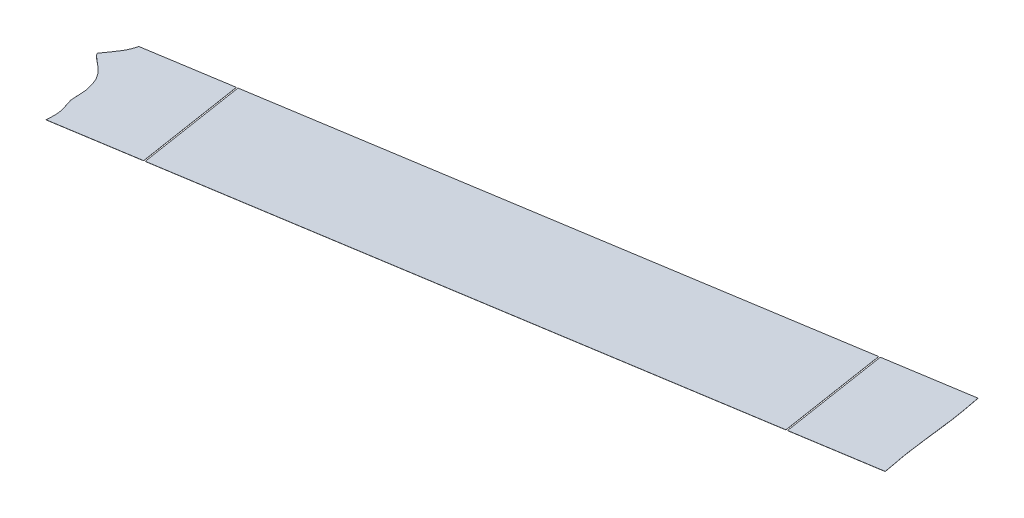
ISO-10303-21;
HEADER;
FILE_DESCRIPTION(('STEP AP214'),'2;1');
FILE_NAME('part.step','',(''),(''),'','','');
FILE_SCHEMA(('AUTOMOTIVE_DESIGN { 1 0 10303 214 1 1 1 1 }'));
ENDSEC;
DATA;
#1=APPLICATION_CONTEXT('core data for automotive mechanical design processes');
#2=APPLICATION_PROTOCOL_DEFINITION('international standard','automotive_design',2000,#1);
#3=PRODUCT_CONTEXT('',#1,'mechanical');
#4=PRODUCT('Part','Part','',(#3));
#5=PRODUCT_RELATED_PRODUCT_CATEGORY('part','',(#4));
#6=PRODUCT_DEFINITION_FORMATION('','',#4);
#7=PRODUCT_DEFINITION_CONTEXT('part definition',#1,'design');
#8=PRODUCT_DEFINITION('design','',#6,#7);
#9=PRODUCT_DEFINITION_SHAPE('','',#8);
#10=(LENGTH_UNIT() NAMED_UNIT(*) SI_UNIT(.MILLI.,.METRE.));
#11=(NAMED_UNIT(*) PLANE_ANGLE_UNIT() SI_UNIT($,.RADIAN.));
#12=(NAMED_UNIT(*) SI_UNIT($,.STERADIAN.) SOLID_ANGLE_UNIT());
#13=UNCERTAINTY_MEASURE_WITH_UNIT(LENGTH_MEASURE(1.E-05),#10,'distance_accuracy_value','');
#14=(GEOMETRIC_REPRESENTATION_CONTEXT(3) GLOBAL_UNCERTAINTY_ASSIGNED_CONTEXT((#13)) GLOBAL_UNIT_ASSIGNED_CONTEXT((#10,
#11,#12)) REPRESENTATION_CONTEXT('',''));
#15=CARTESIAN_POINT('',(0.,0.,0.));
#16=DIRECTION('',(0.,0.,1.));
#17=DIRECTION('',(1.,0.,0.));
#18=AXIS2_PLACEMENT_3D('',#15,#16,#17);
#19=CARTESIAN_POINT('',(2071.33887699728,381.384892477977,167.6098036128));
#20=DIRECTION('',(0.156902088768091,0.00396825396825129,0.987606190493282));
#21=DIRECTION('',(0.987613966521994,0.,-0.15690332415438));
#22=AXIS2_PLACEMENT_3D('',#19,#20,#21);
#23=PLANE('',#22);
#24=DIRECTION('',(-0.987613966521994,0.,0.15690332415438));
#25=VECTOR('',#24,1.);
#26=CARTESIAN_POINT('',(2071.33887699728,381.384892477977,167.6098036128));
#27=LINE('',#26,#25);
#28=CARTESIAN_POINT('',(2010.41756707299,381.384892477977,177.28843956063));
#29=VERTEX_POINT('',#28);
#30=CARTESIAN_POINT('',(1617.34720839724,381.384892477977,239.735962574076));
#31=VERTEX_POINT('',#30);
#32=EDGE_CURVE('E125',#29,#31,#27,.T.);
#33=ORIENTED_EDGE('',*,*,#32,.F.);
#34=DIRECTION('',(-0.00062263223863611,0.999992126449227,-0.00391910304130234));
#35=VECTOR('',#34,1.);
#36=CARTESIAN_POINT('',(2010.42379339538,371.384971213485,177.327630591043));
#37=LINE('',#36,#35);
#38=CARTESIAN_POINT('',(2010.41762933622,381.284893265332,177.288831470933));
#39=VERTEX_POINT('',#38);
#40=EDGE_CURVE('E66',#39,#29,#37,.T.);
#41=ORIENTED_EDGE('',*,*,#40,.F.);
#42=DIRECTION('',(-0.987613966521994,0.,0.15690332415438));
#43=VECTOR('',#42,1.);
#44=CARTESIAN_POINT('',(2071.33893926051,381.284893265333,167.610195523104));
#45=LINE('',#44,#43);
#46=CARTESIAN_POINT('',(1617.34727066046,381.284893265332,239.736354484378));
#47=VERTEX_POINT('',#46);
#48=EDGE_CURVE('E60',#39,#47,#45,.T.);
#49=ORIENTED_EDGE('',*,*,#48,.T.);
#50=DIRECTION('',(-0.00062263223863611,0.999992126449227,-0.00391910304130234));
#51=VECTOR('',#50,1.);
#52=CARTESIAN_POINT('',(1617.35343471963,371.384971213485,239.775153604489));
#53=LINE('',#52,#51);
#54=EDGE_CURVE('E108',#47,#31,#53,.T.);
#55=ORIENTED_EDGE('',*,*,#54,.T.);
#56=EDGE_LOOP('',(#33,#41,#49,#55));
#57=FACE_BOUND('',#56,.T.);
#58=ADVANCED_FACE('F57',(#57),#23,.F.);
#59=CARTESIAN_POINT('',(2083.79012268682,381.699900005905,246.008482464677));
#60=DIRECTION('',(0.156902088768096,0.00396825396825129,0.987606190493282));
#61=DIRECTION('',(0.987613966521993,0.,-0.156903324154385));
#62=AXIS2_PLACEMENT_3D('',#59,#60,#61);
#63=PLANE('',#62);
#64=DIRECTION('',(-0.00062263223863611,0.999992126449227,-0.00391910304130234));
#65=VECTOR('',#64,1.);
#66=CARTESIAN_POINT('',(2022.87897885242,371.699978741413,255.725683527698));
#67=LINE('',#66,#65);
#68=CARTESIAN_POINT('',(2022.87281479326,381.59990079326,255.686884407589));
#69=VERTEX_POINT('',#68);
#70=CARTESIAN_POINT('',(2022.87275253003,381.699900005905,255.686492497285));
#71=VERTEX_POINT('',#70);
#72=EDGE_CURVE('E115',#69,#71,#67,.T.);
#73=ORIENTED_EDGE('',*,*,#72,.T.);
#74=DIRECTION('',(-0.987613966521993,0.,0.156903324154385));
#75=VECTOR('',#74,1.);
#76=CARTESIAN_POINT('',(2083.79012268682,381.699900005905,246.008482464677));
#77=LINE('',#76,#75);
#78=CARTESIAN_POINT('',(1629.80239385428,381.699900005905,318.134015510731));
#79=VERTEX_POINT('',#78);
#80=EDGE_CURVE('E100',#71,#79,#77,.T.);
#81=ORIENTED_EDGE('',*,*,#80,.T.);
#82=DIRECTION('',(-0.00062263223863611,0.999992126449227,-0.00391910304130234));
#83=VECTOR('',#82,1.);
#84=CARTESIAN_POINT('',(1629.80862017666,371.699978741413,318.173206541144));
#85=LINE('',#84,#83);
#86=CARTESIAN_POINT('',(1629.8024561175,381.59990079326,318.134407421035));
#87=VERTEX_POINT('',#86);
#88=EDGE_CURVE('E118',#87,#79,#85,.T.);
#89=ORIENTED_EDGE('',*,*,#88,.F.);
#90=DIRECTION('',(-0.987613966521993,0.,0.156903324154385));
#91=VECTOR('',#90,1.);
#92=CARTESIAN_POINT('',(2083.79018495004,381.59990079326,246.008874374982));
#93=LINE('',#92,#91);
#94=EDGE_CURVE('E89',#69,#87,#93,.T.);
#95=ORIENTED_EDGE('',*,*,#94,.F.);
#96=EDGE_LOOP('',(#73,#81,#89,#95));
#97=FACE_BOUND('',#96,.T.);
#98=ADVANCED_FACE('F129',(#97),#63,.T.);
#99=CARTESIAN_POINT('',(-2946.66746904006,403.192390755681,6529.19275696574));
#100=DIRECTION('',(-0.00062263223863611,0.999992126449227,-0.00391910304130233));
#101=DIRECTION('',(0.,0.00391910380096367,0.99999232028321));
#102=AXIS2_PLACEMENT_3D('',#99,#100,#101);
#103=PLANE('',#102);
#104=DIRECTION('',(0.156902088768101,0.00396825396779671,0.987606190493283));
#105=VECTOR('',#104,1.);
#106=CARTESIAN_POINT('',(2022.87275253003,381.699900005905,255.686492497285));
#107=LINE('',#106,#105);
#108=EDGE_CURVE('E14',#29,#71,#107,.T.);
#109=ORIENTED_EDGE('',*,*,#108,.F.);
#110=ORIENTED_EDGE('',*,*,#32,.T.);
#111=DIRECTION('',(-0.156902088768099,-0.00396825396779671,-0.987606190493283));
#112=VECTOR('',#111,1.);
#113=CARTESIAN_POINT('',(1629.80239385428,381.699900005905,318.134015510731));
#114=LINE('',#113,#112);
#115=EDGE_CURVE('E114',#79,#31,#114,.T.);
#116=ORIENTED_EDGE('',*,*,#115,.F.);
#117=ORIENTED_EDGE('',*,*,#80,.F.);
#118=EDGE_LOOP('',(#109,#110,#116,#117));
#119=FACE_BOUND('',#118,.T.);
#120=ADVANCED_FACE('F130',(#119),#103,.T.);
#121=CARTESIAN_POINT('',(-2946.66740677683,403.092391543036,6529.19314887605));
#122=DIRECTION('',(-0.00062263223863611,0.999992126449227,-0.00391910304130233));
#123=DIRECTION('',(0.,0.00391910380096367,0.99999232028321));
#124=AXIS2_PLACEMENT_3D('',#121,#122,#123);
#125=PLANE('',#124);
#126=ORIENTED_EDGE('',*,*,#48,.F.);
#127=DIRECTION('',(0.156902088768102,0.0039682539677967,0.987606190493283));
#128=VECTOR('',#127,1.);
#129=CARTESIAN_POINT('',(2872.67142114136,403.092391543036,5604.66834725079));
#130=LINE('',#129,#128);
#131=EDGE_CURVE('E75',#39,#69,#130,.T.);
#132=ORIENTED_EDGE('',*,*,#131,.T.);
#133=ORIENTED_EDGE('',*,*,#94,.T.);
#134=DIRECTION('',(-0.156902088768099,-0.0039682539677967,-0.987606190493283));
#135=VECTOR('',#134,1.);
#136=CARTESIAN_POINT('',(2479.6010624656,403.092391543036,5667.11587026425));
#137=LINE('',#136,#135);
#138=EDGE_CURVE('E112',#87,#47,#137,.T.);
#139=ORIENTED_EDGE('',*,*,#138,.T.);
#140=EDGE_LOOP('',(#126,#132,#133,#139));
#141=FACE_BOUND('',#140,.T.);
#142=ADVANCED_FACE('F117',(#141),#125,.F.);
#143=CARTESIAN_POINT('',(1629.80862017666,371.699978741413,318.173206541144));
#144=DIRECTION('',(0.987613966521992,0.,-0.156903324154388));
#145=DIRECTION('',(-0.156903324154388,0.,-0.987613966521993));
#146=AXIS2_PLACEMENT_3D('',#143,#144,#145);
#147=PLANE('',#146);
#148=ORIENTED_EDGE('',*,*,#88,.T.);
#149=ORIENTED_EDGE('',*,*,#115,.T.);
#150=ORIENTED_EDGE('',*,*,#54,.F.);
#151=ORIENTED_EDGE('',*,*,#138,.F.);
#152=EDGE_LOOP('',(#148,#149,#150,#151));
#153=FACE_BOUND('',#152,.T.);
#154=ADVANCED_FACE('F111',(#153),#147,.F.);
#155=CARTESIAN_POINT('',(2022.87897885242,371.699978741413,255.725683527698));
#156=DIRECTION('',(-0.987613966521992,0.,0.156903324154391));
#157=DIRECTION('',(0.156903324154391,0.,0.987613966521992));
#158=AXIS2_PLACEMENT_3D('',#155,#156,#157);
#159=PLANE('',#158);
#160=ORIENTED_EDGE('',*,*,#40,.T.);
#161=ORIENTED_EDGE('',*,*,#108,.T.);
#162=ORIENTED_EDGE('',*,*,#72,.F.);
#163=ORIENTED_EDGE('',*,*,#131,.F.);
#164=EDGE_LOOP('',(#160,#161,#162,#163));
#165=FACE_BOUND('',#164,.T.);
#166=ADVANCED_FACE('F131',(#165),#159,.F.);
#167=CLOSED_SHELL('',(#58,#98,#120,#142,#154,#166));
#168=MANIFOLD_SOLID_BREP('B2',#167);
#169=CARTESIAN_POINT('',(2083.79012268682,381.699900005905,246.008482464679));
#170=CARTESIAN_POINT('',(2083.63100076041,381.696680753274,245.212342937488));
#171=CARTESIAN_POINT('',(2083.54692476346,381.694978013281,244.791231743634));
#172=CARTESIAN_POINT('',(2083.41236880606,381.692252933373,244.11728172317));
#173=CARTESIAN_POINT('',(2083.30421248932,381.690056020657,243.573903866964));
#174=CARTESIAN_POINT('',(2083.1752804441,381.687437103351,242.926148650787));
#175=CARTESIAN_POINT('',(2082.93644158216,381.682562055866,241.720183848063));
#176=CARTESIAN_POINT('',(2082.56804025949,381.674991496594,239.84702025756));
#177=CARTESIAN_POINT('',(2082.34729856242,381.670368050162,238.702378464453));
#178=CARTESIAN_POINT('',(2082.10300687589,381.665251347963,237.435619724111));
#179=CARTESIAN_POINT('',(2081.64810916562,381.655470930142,235.012333902094));
#180=CARTESIAN_POINT('',(2081.20708545204,381.645672781908,232.582319838726));
#181=CARTESIAN_POINT('',(2080.78243656861,381.635865883334,230.147471565162));
#182=CARTESIAN_POINT('',(2080.37579722953,381.626054804134,227.708695373436));
#183=CARTESIAN_POINT('',(2079.98801692212,381.616242486124,225.266606933729));
#184=CARTESIAN_POINT('',(2079.61918813814,381.606431457991,222.821836767649));
#185=CARTESIAN_POINT('',(2079.26868009701,381.596624685287,220.375241773165));
#186=CARTESIAN_POINT('',(2078.93520696045,381.586826780715,217.928203203138));
#187=CARTESIAN_POINT('',(2078.61697031648,381.577046878952,215.48333756265));
#188=CARTESIAN_POINT('',(2078.45668965038,381.571928197684,214.202726922303));
#189=CARTESIAN_POINT('',(2078.31201809104,381.567308004751,213.04682994006));
#190=CARTESIAN_POINT('',(2078.08181921326,381.559735983575,211.151336956759));
#191=CARTESIAN_POINT('',(2077.93523991659,381.554862210029,209.931039831124));
#192=CARTESIAN_POINT('',(2077.85700021854,381.552240227189,209.274448868812));
#193=CARTESIAN_POINT('',(2077.79167157867,381.550050922053,208.726208070414));
#194=CARTESIAN_POINT('',(2077.71051662001,381.547318234565,208.041833035924));
#195=CARTESIAN_POINT('',(2077.66178017357,381.545677158288,207.630841424769));
#196=CARTESIAN_POINT('',(2077.46722720374,381.539115585059,205.987509634997));
#197=CARTESIAN_POINT('',(2077.41848306409,381.537474249317,205.576453041544));
#198=CARTESIAN_POINT('',(2077.33733941831,381.53474194207,204.892173231685));
#199=CARTESIAN_POINT('',(2077.27199946555,381.532552256693,204.343837208654));
#200=CARTESIAN_POINT('',(2077.19377147413,381.529930664824,203.687344145871));
#201=CARTESIAN_POINT('',(2077.04719228637,381.525056891246,202.467046994773));
#202=CARTESIAN_POINT('',(2076.81699367081,381.517484871326,200.571554290554));
#203=CARTESIAN_POINT('',(2076.67231003371,381.512864286198,199.415559155166));
#204=CARTESIAN_POINT('',(2076.51204195025,381.507745999584,198.135047215058));
#205=CARTESIAN_POINT('',(2076.19380584808,381.497966097976,195.690181528328));
#206=CARTESIAN_POINT('',(2075.86033352064,381.488168198367,193.243144095872));
#207=CARTESIAN_POINT('',(2075.50982607054,381.478361422064,190.796548089197));
#208=CARTESIAN_POINT('',(2075.14099806021,381.468550394756,188.351778010634));
#209=CARTESIAN_POINT('',(2074.9451502618,381.463594689893,187.118402761275));
#210=CARTESIAN_POINT('',(2074.74943635516,381.458644834115,185.886498683729));
#211=CARTESIAN_POINT('',(2074.34314499168,381.448846119932,183.450822246676));
#212=CARTESIAN_POINT('',(2073.91889906168,381.439051592534,181.019066565374));
#213=CARTESIAN_POINT('',(2073.47833253701,381.429265810451,178.592135195488));
#214=CARTESIAN_POINT('',(2073.0239417836,381.419497743306,176.171920211721));
#215=CARTESIAN_POINT('',(2072.7799153439,381.414387032104,174.906647984319));
#216=CARTESIAN_POINT('',(2072.5594561504,381.409769896062,173.763571458903));
#217=CARTESIAN_POINT('',(2072.19150473933,381.40220887205,171.892769392025));
#218=CARTESIAN_POINT('',(2071.95296333888,381.397340001385,170.688333399093));
#219=CARTESIAN_POINT('',(2071.82417341825,381.394723996019,170.041298609471));
#220=CARTESIAN_POINT('',(2071.71617161742,381.392530242898,169.498702402193));
#221=CARTESIAN_POINT('',(2071.58176712438,381.389808236998,168.825512677576));
#222=CARTESIAN_POINT('',(2071.49780240828,381.388107754764,168.404959890719));
#223=CARTESIAN_POINT('',(2071.33887699728,381.384892477977,167.609803612801));
#224=B_SPLINE_CURVE_WITH_KNOTS('',2,(#169,#170,#171,#172,#173,#174,#175,#176,#177,#178,#179,
#180,#181,#182,#183,#184,#185,#186,#187,#188,#189,#190,#191,#192,#193,#194,#195,#196,#197,#198,
#199,#200,#201,#202,#203,#204,#205,#206,#207,#208,#209,#210,#211,#212,#213,#214,#215,#216,#217,
#218,#219,#220,#221,#222,#223),.UNSPECIFIED.,.F.,.F.,(3,2,2,1,1,2,1,1,1,1,1,1,1,1,1,2,1,1,2,2,1,
2,2,1,1,2,1,1,1,1,1,1,1,1,1,1,2,1,1,2,2,3),(0.,0.015625,0.03125,0.046875,0.0625,0.09375,0.125,
0.15625,0.1875,0.21875,0.25,0.28125,0.3125,0.34375,0.375,0.40625,0.4375,0.453125,0.46875,
0.484375,0.5,0.515625,0.53125,0.546875,0.5625,0.59375,0.625,0.65625,0.6875,0.71875,0.75,
0.750316619873047,0.781527042388916,0.812737464904785,0.843947887420654,0.875158309936523,
0.906368732452393,0.937579154968262,0.953184366226196,0.968789577484131,0.984394788742065,1.),.UNSPECIFIED.);
#225=DIRECTION('',(0.000622632238707982,-0.999992126449225,0.00391910304175121));
#226=VECTOR('',#225,1.);
#227=SURFACE_OF_LINEAR_EXTRUSION('',#224,#226);
#228=CARTESIAN_POINT('',(2083.79018495004,381.59990079326,246.008874374983));
#229=CARTESIAN_POINT('',(2083.63106302364,381.596681540629,245.212734847793));
#230=CARTESIAN_POINT('',(2083.54698702669,381.594978800636,244.791623653938));
#231=CARTESIAN_POINT('',(2083.41243106928,381.592253720728,244.117673633474));
#232=CARTESIAN_POINT('',(2083.30427475254,381.590056808012,243.574295777268));
#233=CARTESIAN_POINT('',(2083.17534270732,381.587437890706,242.926540561091));
#234=CARTESIAN_POINT('',(2082.93650384539,381.582562843221,241.720575758368));
#235=CARTESIAN_POINT('',(2082.56810252271,381.574992283949,239.847412167864));
#236=CARTESIAN_POINT('',(2082.34736082565,381.570368837517,238.702770374757));
#237=CARTESIAN_POINT('',(2082.10306913912,381.565252135318,237.436011634415));
#238=CARTESIAN_POINT('',(2081.64817142884,381.555471717497,235.012725812398));
#239=CARTESIAN_POINT('',(2081.20714771527,381.545673569263,232.58271174903));
#240=CARTESIAN_POINT('',(2080.78249883183,381.535866670689,230.147863475466));
#241=CARTESIAN_POINT('',(2080.37585949275,381.526055591489,227.70908728374));
#242=CARTESIAN_POINT('',(2079.98807918535,381.516243273479,225.266998844033));
#243=CARTESIAN_POINT('',(2079.61925040136,381.506432245346,222.822228677953));
#244=CARTESIAN_POINT('',(2079.26874236023,381.496625472642,220.37563368347));
#245=CARTESIAN_POINT('',(2078.93526922368,381.486827568071,217.928595113443));
#246=CARTESIAN_POINT('',(2078.61703257971,381.477047666307,215.483729472954));
#247=CARTESIAN_POINT('',(2078.45675191361,381.471928985039,214.203118832607));
#248=CARTESIAN_POINT('',(2078.31208035426,381.467308792107,213.047221850364));
#249=CARTESIAN_POINT('',(2078.08188147649,381.45973677093,211.151728867063));
#250=CARTESIAN_POINT('',(2077.93530217981,381.454862997384,209.931431741428));
#251=CARTESIAN_POINT('',(2077.85706248177,381.452241014544,209.274840779117));
#252=CARTESIAN_POINT('',(2077.79173384189,381.450051709409,208.726599980719));
#253=CARTESIAN_POINT('',(2077.71057888323,381.44731902192,208.042224946229));
#254=CARTESIAN_POINT('',(2077.66184243679,381.445677945643,207.631233335073));
#255=CARTESIAN_POINT('',(2077.46728946696,381.439116372414,205.987901545302));
#256=CARTESIAN_POINT('',(2077.41854532731,381.437475036672,205.576844951848));
#257=CARTESIAN_POINT('',(2077.33740168154,381.434742729425,204.89256514199));
#258=CARTESIAN_POINT('',(2077.27206172878,381.432553044048,204.344229118958));
#259=CARTESIAN_POINT('',(2077.19383373735,381.429931452179,203.687736056175));
#260=CARTESIAN_POINT('',(2077.04725454959,381.425057678601,202.467438905077));
#261=CARTESIAN_POINT('',(2076.81705593404,381.417485658681,200.571946200858));
#262=CARTESIAN_POINT('',(2076.67237229694,381.412865073553,199.415951065471));
#263=CARTESIAN_POINT('',(2076.51210421347,381.407746786939,198.135439125362));
#264=CARTESIAN_POINT('',(2076.19386811131,381.397966885332,195.690573438633));
#265=CARTESIAN_POINT('',(2075.86039578386,381.388168985722,193.243536006176));
#266=CARTESIAN_POINT('',(2075.50988833377,381.378362209419,190.796939999501));
#267=CARTESIAN_POINT('',(2075.14106032343,381.368551182111,188.352169920939));
#268=CARTESIAN_POINT('',(2074.94521252502,381.363595477248,187.11879467158));
#269=CARTESIAN_POINT('',(2074.74949861839,381.358645621471,185.886890594034));
#270=CARTESIAN_POINT('',(2074.3432072549,381.348846907287,183.45121415698));
#271=CARTESIAN_POINT('',(2073.9189613249,381.339052379889,181.019458475678));
#272=CARTESIAN_POINT('',(2073.47839480024,381.329266597806,178.592527105793));
#273=CARTESIAN_POINT('',(2073.02400404682,381.319498530661,176.172312122026));
#274=CARTESIAN_POINT('',(2072.77997760712,381.314387819459,174.907039894624));
#275=CARTESIAN_POINT('',(2072.55951841363,381.309770683417,173.763963369207));
#276=CARTESIAN_POINT('',(2072.19156700256,381.302209659405,171.893161302329));
#277=CARTESIAN_POINT('',(2071.95302560211,381.29734078874,170.688725309397));
#278=CARTESIAN_POINT('',(2071.82423568147,381.294724783375,170.041690519775));
#279=CARTESIAN_POINT('',(2071.71623388065,381.292531030253,169.499094312497));
#280=CARTESIAN_POINT('',(2071.58182938761,381.289809024353,168.82590458788));
#281=CARTESIAN_POINT('',(2071.4978646715,381.288108542119,168.405351801023));
#282=CARTESIAN_POINT('',(2071.33893926051,381.284893265332,167.610195523105));
#283=B_SPLINE_CURVE_WITH_KNOTS('',2,(#228,#229,#230,#231,#232,#233,#234,#235,#236,#237,#238,
#239,#240,#241,#242,#243,#244,#245,#246,#247,#248,#249,#250,#251,#252,#253,#254,#255,#256,#257,
#258,#259,#260,#261,#262,#263,#264,#265,#266,#267,#268,#269,#270,#271,#272,#273,#274,#275,#276,
#277,#278,#279,#280,#281,#282),.UNSPECIFIED.,.F.,.F.,(3,2,2,1,1,2,1,1,1,1,1,1,1,1,1,2,1,1,2,2,1,
2,2,1,1,2,1,1,1,1,1,1,1,1,1,1,2,1,1,2,2,3),(0.,0.015625,0.03125,0.046875,0.0625,0.09375,0.125,
0.15625,0.1875,0.21875,0.25,0.28125,0.3125,0.34375,0.375,0.40625,0.4375,0.453125,0.46875,
0.484375,0.5,0.515625,0.53125,0.546875,0.5625,0.59375,0.625,0.65625,0.6875,0.71875,0.75,
0.750316619873047,0.781527042388916,0.812737464904785,0.843947887420654,0.875158309936523,
0.906368732452393,0.937579154968262,0.953184366226196,0.968789577484131,0.984394788742065,1.),.UNSPECIFIED.);
#284=CARTESIAN_POINT('',(2083.79018495004,381.59990079326,246.008874374982));
#285=VERTEX_POINT('',#284);
#286=CARTESIAN_POINT('',(2071.33893926051,381.284893265332,167.610195523105));
#287=VERTEX_POINT('',#286);
#288=EDGE_CURVE('E260',#285,#287,#283,.T.);
#289=ORIENTED_EDGE('',*,*,#288,.T.);
#290=DIRECTION('',(0.000622632238707982,-0.999992126449225,0.00391910304175121));
#291=VECTOR('',#290,1.);
#292=CARTESIAN_POINT('',(2071.33887699728,381.384892477977,167.609803612801));
#293=LINE('',#292,#291);
#294=CARTESIAN_POINT('',(2071.33887699728,381.384892477977,167.609803612801));
#295=VERTEX_POINT('',#294);
#296=EDGE_CURVE('E248',#295,#287,#293,.T.);
#297=ORIENTED_EDGE('',*,*,#296,.F.);
#298=CARTESIAN_POINT('',(2083.79012268682,381.699900005905,246.008482464677));
#299=VERTEX_POINT('',#298);
#300=EDGE_CURVE('E247',#299,#295,#224,.T.);
#301=ORIENTED_EDGE('',*,*,#300,.F.);
#302=DIRECTION('',(0.000622632238707982,-0.999992126449225,0.00391910304175121));
#303=VECTOR('',#302,1.);
#304=CARTESIAN_POINT('',(2083.79012268682,381.699900005905,246.008482464677));
#305=LINE('',#304,#303);
#306=EDGE_CURVE('E197',#299,#285,#305,.T.);
#307=ORIENTED_EDGE('',*,*,#306,.T.);
#308=EDGE_LOOP('',(#289,#297,#301,#307));
#309=FACE_BOUND('',#308,.T.);
#310=ADVANCED_FACE('F189',(#309),#227,.F.);
#311=CARTESIAN_POINT('',(-2946.66746904006,403.192390755681,6529.19275696574));
#312=DIRECTION('',(-0.00062263223863611,0.999992126449227,-0.00391910304130233));
#313=DIRECTION('',(0.,0.00391910380096367,0.99999232028321));
#314=AXIS2_PLACEMENT_3D('',#311,#312,#313);
#315=PLANE('',#314);
#316=DIRECTION('',(-0.156902088768096,-0.00396825396779671,-0.987606190493283));
#317=VECTOR('',#316,1.);
#318=CARTESIAN_POINT('',(2011.40518103951,381.384892477977,177.131536236475));
#319=LINE('',#318,#317);
#320=CARTESIAN_POINT('',(2023.86036649655,381.699900005905,255.52958917313));
#321=VERTEX_POINT('',#320);
#322=CARTESIAN_POINT('',(2011.40518103951,381.384892477977,177.131536236475));
#323=VERTEX_POINT('',#322);
#324=EDGE_CURVE('E232',#321,#323,#319,.T.);
#325=ORIENTED_EDGE('',*,*,#324,.F.);
#326=DIRECTION('',(-0.987613966521993,0.,0.156903324154385));
#327=VECTOR('',#326,1.);
#328=CARTESIAN_POINT('',(2083.79012268682,381.699900005905,246.008482464677));
#329=LINE('',#328,#327);
#330=EDGE_CURVE('E244',#299,#321,#329,.T.);
#331=ORIENTED_EDGE('',*,*,#330,.F.);
#332=ORIENTED_EDGE('',*,*,#300,.T.);
#333=DIRECTION('',(-0.987613966521994,0.,0.15690332415438));
#334=VECTOR('',#333,1.);
#335=CARTESIAN_POINT('',(2071.33887699728,381.384892477977,167.6098036128));
#336=LINE('',#335,#334);
#337=EDGE_CURVE('E225',#295,#323,#336,.T.);
#338=ORIENTED_EDGE('',*,*,#337,.T.);
#339=EDGE_LOOP('',(#325,#331,#332,#338));
#340=FACE_BOUND('',#339,.T.);
#341=ADVANCED_FACE('F243',(#340),#315,.T.);
#342=CARTESIAN_POINT('',(-2946.66740677683,403.092391543036,6529.19314887605));
#343=DIRECTION('',(-0.00062263223863611,0.999992126449227,-0.00391910304130233));
#344=DIRECTION('',(0.,0.00391910380096367,0.99999232028321));
#345=AXIS2_PLACEMENT_3D('',#342,#343,#344);
#346=PLANE('',#345);
#347=DIRECTION('',(-0.987613966521993,0.,0.156903324154385));
#348=VECTOR('',#347,1.);
#349=CARTESIAN_POINT('',(2083.79018495004,381.59990079326,246.008874374982));
#350=LINE('',#349,#348);
#351=CARTESIAN_POINT('',(2023.86042875978,381.59990079326,255.529981083434));
#352=VERTEX_POINT('',#351);
#353=EDGE_CURVE('E259',#285,#352,#350,.T.);
#354=ORIENTED_EDGE('',*,*,#353,.T.);
#355=DIRECTION('',(-0.156902088768096,-0.0039682539677967,-0.987606190493283));
#356=VECTOR('',#355,1.);
#357=CARTESIAN_POINT('',(2873.65903510786,403.092391543036,5604.51144392667));
#358=LINE('',#357,#356);
#359=CARTESIAN_POINT('',(2011.40524330274,381.284893265332,177.131928146781));
#360=VERTEX_POINT('',#359);
#361=EDGE_CURVE('E55',#352,#360,#358,.T.);
#362=ORIENTED_EDGE('',*,*,#361,.T.);
#363=DIRECTION('',(-0.987613966521994,0.,0.15690332415438));
#364=VECTOR('',#363,1.);
#365=CARTESIAN_POINT('',(2071.33893926051,381.284893265333,167.610195523104));
#366=LINE('',#365,#364);
#367=EDGE_CURVE('E251',#287,#360,#366,.T.);
#368=ORIENTED_EDGE('',*,*,#367,.F.);
#369=ORIENTED_EDGE('',*,*,#288,.F.);
#370=EDGE_LOOP('',(#354,#362,#368,#369));
#371=FACE_BOUND('',#370,.T.);
#372=ADVANCED_FACE('F271',(#371),#346,.F.);
#373=CARTESIAN_POINT('',(2083.79012268682,381.699900005905,246.008482464677));
#374=DIRECTION('',(0.156902088768096,0.00396825396825129,0.987606190493282));
#375=DIRECTION('',(0.987613966521993,0.,-0.156903324154385));
#376=AXIS2_PLACEMENT_3D('',#373,#374,#375);
#377=PLANE('',#376);
#378=DIRECTION('',(-0.00062263223863611,0.999992126449227,-0.00391910304130234));
#379=VECTOR('',#378,1.);
#380=CARTESIAN_POINT('',(2023.86659281894,371.699978741413,255.568780203543));
#381=LINE('',#380,#379);
#382=EDGE_CURVE('E234',#352,#321,#381,.T.);
#383=ORIENTED_EDGE('',*,*,#382,.F.);
#384=ORIENTED_EDGE('',*,*,#353,.F.);
#385=ORIENTED_EDGE('',*,*,#306,.F.);
#386=ORIENTED_EDGE('',*,*,#330,.T.);
#387=EDGE_LOOP('',(#383,#384,#385,#386));
#388=FACE_BOUND('',#387,.T.);
#389=ADVANCED_FACE('F246',(#388),#377,.T.);
#390=CARTESIAN_POINT('',(2071.33887699728,381.384892477977,167.6098036128));
#391=DIRECTION('',(0.156902088768091,0.00396825396825129,0.987606190493282));
#392=DIRECTION('',(0.987613966521994,0.,-0.15690332415438));
#393=AXIS2_PLACEMENT_3D('',#390,#391,#392);
#394=PLANE('',#393);
#395=ORIENTED_EDGE('',*,*,#367,.T.);
#396=DIRECTION('',(-0.00062263223863611,0.999992126449227,-0.00391910304130234));
#397=VECTOR('',#396,1.);
#398=CARTESIAN_POINT('',(2011.4114073619,371.384971213485,177.170727266888));
#399=LINE('',#398,#397);
#400=EDGE_CURVE('E204',#360,#323,#399,.T.);
#401=ORIENTED_EDGE('',*,*,#400,.T.);
#402=ORIENTED_EDGE('',*,*,#337,.F.);
#403=ORIENTED_EDGE('',*,*,#296,.T.);
#404=EDGE_LOOP('',(#395,#401,#402,#403));
#405=FACE_BOUND('',#404,.T.);
#406=ADVANCED_FACE('F191',(#405),#394,.F.);
#407=CARTESIAN_POINT('',(2011.4114073619,371.384971213485,177.170727266888));
#408=DIRECTION('',(0.987613966521993,0.,-0.156903324154385));
#409=DIRECTION('',(-0.156903324154385,0.,-0.987613966521993));
#410=AXIS2_PLACEMENT_3D('',#407,#408,#409);
#411=PLANE('',#410);
#412=ORIENTED_EDGE('',*,*,#382,.T.);
#413=ORIENTED_EDGE('',*,*,#324,.T.);
#414=ORIENTED_EDGE('',*,*,#400,.F.);
#415=ORIENTED_EDGE('',*,*,#361,.F.);
#416=EDGE_LOOP('',(#412,#413,#414,#415));
#417=FACE_BOUND('',#416,.T.);
#418=ADVANCED_FACE('F235',(#417),#411,.F.);
#419=CLOSED_SHELL('',(#310,#341,#372,#389,#406,#418));
#420=MANIFOLD_SOLID_BREP('B8',#419);
#421=CARTESIAN_POINT('',(1556.42589847295,381.384892477977,249.414598521908));
#422=CARTESIAN_POINT('',(1556.19009339261,381.389920822655,250.735085602036));
#423=CARTESIAN_POINT('',(1555.37852415196,381.39935647511,253.271606645599));
#424=CARTESIAN_POINT('',(1554.80554035613,381.404110913768,254.575772255407));
#425=CARTESIAN_POINT('',(1554.75004560312,381.40456442998,254.700307246603));
#426=CARTESIAN_POINT('',(1554.23889534797,381.40868682257,255.83337741925));
#427=CARTESIAN_POINT('',(1553.59221942049,381.412929501415,257.018670755946));
#428=CARTESIAN_POINT('',(1553.52836703284,381.413344479694,257.134700256103));
#429=CARTESIAN_POINT('',(1552.92754953274,381.41721455027,258.217633877648));
#430=CARTESIAN_POINT('',(1552.19779519358,381.421298749177,259.375688483444));
#431=CARTESIAN_POINT('',(1552.12743284589,381.421689999827,259.486697923854));
#432=CARTESIAN_POINT('',(1551.48086588967,381.425264127463,260.501387480279));
#433=CARTESIAN_POINT('',(1550.69560963485,381.429229361001,261.637904721713));
#434=CARTESIAN_POINT('',(1550.29424427014,381.431247878078,262.216711702689));
#435=CARTESIAN_POINT('',(1549.87393051437,381.43329563274,262.805989251447));
#436=CARTESIAN_POINT('',(1549.53134325519,381.434964706491,263.286294684131));
#437=CARTESIAN_POINT('',(1549.07661173354,381.437140123997,263.913614470652));
#438=CARTESIAN_POINT('',(1548.92548724434,381.437863097541,264.12209657007));
#439=CARTESIAN_POINT('',(1548.37735779305,381.44047732689,264.876221124102));
#440=CARTESIAN_POINT('',(1548.27071025711,381.440986954572,265.023200128556));
#441=CARTESIAN_POINT('',(1547.78084917193,381.443327812868,265.698314597782));
#442=CARTESIAN_POINT('',(1547.47033067203,381.444847511786,266.13541098511));
#443=CARTESIAN_POINT('',(1547.01585748609,381.447071734848,266.775142877977));
#444=CARTESIAN_POINT('',(1546.68936085489,381.448780903208,267.263122451655));
#445=CARTESIAN_POINT('',(1546.25633282416,381.451047749902,267.910323107444));
#446=CARTESIAN_POINT('',(1545.96115399535,381.452862233206,268.420199181511));
#447=B_SPLINE_CURVE_WITH_KNOTS('',2,(#421,#422,#423,#424,#425,#426,#427,#428,#429,#430,#431,
#432,#433,#434,#435,#436,#437,#438,#439,#440,#441,#442,#443,#444,#445,#446),.UNSPECIFIED.,.F.,
.F.,(3,1,1,1,1,1,1,1,1,1,1,1,1,2,2,1,2,2,2,3),(0.,0.125,0.24375,0.25,0.25625,0.3690625,0.375,
0.38125,0.4940625,0.5,0.50625,0.6190625,0.625,0.6875,0.75,0.78125,0.8125,0.875,0.9375,1.),.UNSPECIFIED.);
#448=DIRECTION('',(0.000622632238707982,-0.999992126449225,0.00391910304175121));
#449=VECTOR('',#448,1.);
#450=SURFACE_OF_LINEAR_EXTRUSION('',#447,#449);
#451=CARTESIAN_POINT('',(1556.42596073617,381.284893265332,249.414990432213));
#452=CARTESIAN_POINT('',(1556.19015565583,381.28992161001,250.73547751234));
#453=CARTESIAN_POINT('',(1555.37858641519,381.299357262465,253.271998555903));
#454=CARTESIAN_POINT('',(1554.80560261935,381.304111701123,254.576164165712));
#455=CARTESIAN_POINT('',(1554.75010786635,381.304565217335,254.700699156907));
#456=CARTESIAN_POINT('',(1554.2389576112,381.308687609925,255.833769329554));
#457=CARTESIAN_POINT('',(1553.59228168371,381.31293028877,257.01906266625));
#458=CARTESIAN_POINT('',(1553.52842929606,381.313345267049,257.135092166407));
#459=CARTESIAN_POINT('',(1552.92761179596,381.317215337625,258.218025787952));
#460=CARTESIAN_POINT('',(1552.1978574568,381.321299536532,259.376080393748));
#461=CARTESIAN_POINT('',(1552.12749510912,381.321690787182,259.487089834158));
#462=CARTESIAN_POINT('',(1551.48092815289,381.325264914818,260.501779390583));
#463=CARTESIAN_POINT('',(1550.69567189807,381.329230148356,261.638296632017));
#464=CARTESIAN_POINT('',(1550.29430653336,381.331248665433,262.217103612993));
#465=CARTESIAN_POINT('',(1549.8739927776,381.333296420095,262.806381161751));
#466=CARTESIAN_POINT('',(1549.53140551842,381.334965493846,263.286686594435));
#467=CARTESIAN_POINT('',(1549.07667399677,381.337140911352,263.914006380956));
#468=CARTESIAN_POINT('',(1548.92554950756,381.337863884896,264.122488480374));
#469=CARTESIAN_POINT('',(1548.37742005628,381.340478114245,264.876613034406));
#470=CARTESIAN_POINT('',(1548.27077252033,381.340987741927,265.02359203886));
#471=CARTESIAN_POINT('',(1547.78091143515,381.343328600223,265.698706508086));
#472=CARTESIAN_POINT('',(1547.47039293525,381.344848299141,266.135802895414));
#473=CARTESIAN_POINT('',(1547.01591974931,381.347072522203,266.775534788281));
#474=CARTESIAN_POINT('',(1546.68942311811,381.348781690563,267.263514361959));
#475=CARTESIAN_POINT('',(1546.25639508739,381.351048537257,267.910715017748));
#476=CARTESIAN_POINT('',(1545.96121625858,381.352863020562,268.420591091815));
#477=B_SPLINE_CURVE_WITH_KNOTS('',2,(#451,#452,#453,#454,#455,#456,#457,#458,#459,#460,#461,
#462,#463,#464,#465,#466,#467,#468,#469,#470,#471,#472,#473,#474,#475,#476),.UNSPECIFIED.,.F.,
.F.,(3,1,1,1,1,1,1,1,1,1,1,1,1,2,2,1,2,2,2,3),(0.,0.125,0.24375,0.25,0.25625,0.3690625,0.375,
0.38125,0.4940625,0.5,0.50625,0.6190625,0.625,0.6875,0.75,0.78125,0.8125,0.875,0.9375,1.),.UNSPECIFIED.);
#478=CARTESIAN_POINT('',(1556.42596073617,381.284893265332,249.414990432213));
#479=VERTEX_POINT('',#478);
#480=CARTESIAN_POINT('',(1545.96121653857,381.35286301884,268.420590608169));
#481=VERTEX_POINT('',#480);
#482=EDGE_CURVE('E476',#479,#481,#477,.T.);
#483=ORIENTED_EDGE('',*,*,#482,.T.);
#484=DIRECTION('',(0.000622632238707982,-0.999992126449225,0.00391910304175121));
#485=VECTOR('',#484,1.);
#486=CARTESIAN_POINT('',(1545.96115427535,381.452862231485,268.420198697865));
#487=LINE('',#486,#485);
#488=CARTESIAN_POINT('',(1545.96115427535,381.452862231485,268.420198697865));
#489=VERTEX_POINT('',#488);
#490=EDGE_CURVE('E514',#489,#481,#487,.T.);
#491=ORIENTED_EDGE('',*,*,#490,.F.);
#492=CARTESIAN_POINT('',(1556.42589847295,381.384892477977,249.414598521908));
#493=VERTEX_POINT('',#492);
#494=EDGE_CURVE('E448',#493,#489,#447,.T.);
#495=ORIENTED_EDGE('',*,*,#494,.F.);
#496=DIRECTION('',(0.000622632238707982,-0.999992126449225,0.00391910304175121));
#497=VECTOR('',#496,1.);
#498=CARTESIAN_POINT('',(1556.42589847295,381.384892477977,249.414598521908));
#499=LINE('',#498,#497);
#500=EDGE_CURVE('E331',#493,#479,#499,.T.);
#501=ORIENTED_EDGE('',*,*,#500,.T.);
#502=EDGE_LOOP('',(#483,#491,#495,#501));
#503=FACE_BOUND('',#502,.T.);
#504=ADVANCED_FACE('F323',(#503),#450,.F.);
#505=CARTESIAN_POINT('',(1545.96115399535,381.452862233206,268.42019918151));
#506=CARTESIAN_POINT('',(1546.04638038849,381.45366577287,268.611689078258));
#507=CARTESIAN_POINT('',(1546.26437467638,381.455306391937,268.995673847799));
#508=CARTESIAN_POINT('',(1546.62160944332,381.457582775689,269.519758038584));
#509=CARTESIAN_POINT('',(1547.31402867999,381.461170908684,270.325294961605));
#510=CARTESIAN_POINT('',(1548.01126941156,381.464224915358,270.993779061815));
#511=CARTESIAN_POINT('',(1548.72507311415,381.467247691385,271.651663022194));
#512=CARTESIAN_POINT('',(1549.5063988996,381.470315564681,272.310326622242));
#513=CARTESIAN_POINT('',(1550.03092587712,381.472375118247,272.752506867371));
#514=CARTESIAN_POINT('',(1550.85605100636,381.4755392982,273.428785471314));
#515=CARTESIAN_POINT('',(1551.1956302187,381.476841512493,273.707107082796));
#516=CARTESIAN_POINT('',(1551.92166529732,381.479630482021,274.303390134918));
#517=CARTESIAN_POINT('',(1552.21370391327,381.480759756377,274.545137493376));
#518=CARTESIAN_POINT('',(1552.96806499142,381.48367677,275.169591890864));
#519=CARTESIAN_POINT('',(1553.56513622069,381.48605167486,275.680711487406));
#520=CARTESIAN_POINT('',(1554.26982638971,381.488854643795,276.283957695256));
#521=CARTESIAN_POINT('',(1555.5556926691,381.494205697651,277.445037125071));
#522=CARTESIAN_POINT('',(1556.22202242505,381.497153568991,278.091350762536));
#523=CARTESIAN_POINT('',(1557.49306246394,381.502820013238,279.335260166009));
#524=CARTESIAN_POINT('',(1558.51428449982,381.508160809455,280.535766596913));
#525=CARTESIAN_POINT('',(1558.62416075349,381.508741052334,280.666364289055));
#526=CARTESIAN_POINT('',(1559.79957002425,381.515021900746,282.082237052708));
#527=CARTESIAN_POINT('',(1561.12189138001,381.524140989836,284.198970727876));
#528=CARTESIAN_POINT('',(1561.92405752607,381.530746927301,285.757090247939));
#529=CARTESIAN_POINT('',(1562.59002802175,381.537532232282,287.382614452902));
#530=CARTESIAN_POINT('',(1563.11350308352,381.544437467589,289.061378297418));
#531=CARTESIAN_POINT('',(1563.31280980007,381.548000770552,289.938920960604));
#532=B_SPLINE_CURVE_WITH_KNOTS('',2,(#505,#506,#507,#508,#509,#510,#511,#512,#513,#514,#515,
#516,#517,#518,#519,#520,#521,#522,#523,#524,#525,#526,#527,#528,#529,#530,#531),.UNSPECIFIED.,
.F.,.F.,(3,1,1,1,1,1,2,2,1,2,2,1,1,1,1,1,1,1,1,1,1,3),(0.,0.015625,0.03125,0.0625,
0.109209060668945,0.125,0.1875,0.25,0.28125,0.3125,0.375,0.4375,0.5,0.50625,0.6190625,0.625,
0.63125,0.75,0.8125,0.875,0.9375,1.),.UNSPECIFIED.);
#533=DIRECTION('',(0.000622632238707982,-0.999992126449225,0.00391910304175121));
#534=VECTOR('',#533,1.);
#535=SURFACE_OF_LINEAR_EXTRUSION('',#532,#534);
#536=CARTESIAN_POINT('',(1545.96121625857,381.352863020562,268.420591091815));
#537=CARTESIAN_POINT('',(1546.04644265172,381.353666560225,268.612080988562));
#538=CARTESIAN_POINT('',(1546.26443693961,381.355307179292,268.996065758103));
#539=CARTESIAN_POINT('',(1546.62167170655,381.357583563044,269.520149948888));
#540=CARTESIAN_POINT('',(1547.31409094321,381.361171696039,270.325686871909));
#541=CARTESIAN_POINT('',(1548.01133167479,381.364225702713,270.994170972119));
#542=CARTESIAN_POINT('',(1548.72513537738,381.36724847874,271.652054932499));
#543=CARTESIAN_POINT('',(1549.50646116282,381.370316352036,272.310718532546));
#544=CARTESIAN_POINT('',(1550.03098814034,381.372375905602,272.752898777675));
#545=CARTESIAN_POINT('',(1550.85611326959,381.375540085555,273.429177381618));
#546=CARTESIAN_POINT('',(1551.19569248193,381.376842299848,273.7074989931));
#547=CARTESIAN_POINT('',(1551.92172756055,381.379631269376,274.303782045222));
#548=CARTESIAN_POINT('',(1552.2137661765,381.380760543732,274.54552940368));
#549=CARTESIAN_POINT('',(1552.96812725465,381.383677557355,275.169983801168));
#550=CARTESIAN_POINT('',(1553.56519848392,381.386052462215,275.68110339771));
#551=CARTESIAN_POINT('',(1554.26988865293,381.38885543115,276.28434960556));
#552=CARTESIAN_POINT('',(1555.55575493233,381.394206485006,277.445429035375));
#553=CARTESIAN_POINT('',(1556.22208468827,381.397154356346,278.09174267284));
#554=CARTESIAN_POINT('',(1557.49312472716,381.402820800593,279.335652076313));
#555=CARTESIAN_POINT('',(1558.51434676304,381.40816159681,280.536158507217));
#556=CARTESIAN_POINT('',(1558.62422301671,381.408741839689,280.666756199359));
#557=CARTESIAN_POINT('',(1559.79963228748,381.415022688101,282.082628963012));
#558=CARTESIAN_POINT('',(1561.12195364323,381.424141777191,284.19936263818));
#559=CARTESIAN_POINT('',(1561.9241197893,381.430747714656,285.757482158243));
#560=CARTESIAN_POINT('',(1562.59009028498,381.437533019637,287.383006363206));
#561=CARTESIAN_POINT('',(1563.11356534674,381.444438254944,289.061770207722));
#562=CARTESIAN_POINT('',(1563.31287206329,381.448001557907,289.939312870908));
#563=B_SPLINE_CURVE_WITH_KNOTS('',2,(#536,#537,#538,#539,#540,#541,#542,#543,#544,#545,#546,
#547,#548,#549,#550,#551,#552,#553,#554,#555,#556,#557,#558,#559,#560,#561,#562),.UNSPECIFIED.,
.F.,.F.,(3,1,1,1,1,1,2,2,1,2,2,1,1,1,1,1,1,1,1,1,1,3),(0.,0.015625,0.03125,0.0625,
0.109209060668945,0.125,0.1875,0.25,0.28125,0.3125,0.375,0.4375,0.5,0.50625,0.6190625,0.625,
0.63125,0.75,0.8125,0.875,0.9375,1.),.UNSPECIFIED.);
#564=CARTESIAN_POINT('',(1563.31287206329,381.448001557907,289.939312870908));
#565=VERTEX_POINT('',#564);
#566=EDGE_CURVE('E480',#481,#565,#563,.T.);
#567=ORIENTED_EDGE('',*,*,#566,.T.);
#568=DIRECTION('',(0.000622632238707982,-0.999992126449225,0.00391910304175121));
#569=VECTOR('',#568,1.);
#570=CARTESIAN_POINT('',(1563.31280980007,381.548000770552,289.938920960604));
#571=LINE('',#570,#569);
#572=CARTESIAN_POINT('',(1563.31280980007,381.548000770552,289.938920960604));
#573=VERTEX_POINT('',#572);
#574=EDGE_CURVE('E410',#573,#565,#571,.T.);
#575=ORIENTED_EDGE('',*,*,#574,.F.);
#576=EDGE_CURVE('E398',#489,#573,#532,.T.);
#577=ORIENTED_EDGE('',*,*,#576,.F.);
#578=ORIENTED_EDGE('',*,*,#490,.T.);
#579=EDGE_LOOP('',(#567,#575,#577,#578));
#580=FACE_BOUND('',#579,.T.);
#581=ADVANCED_FACE('F441',(#580),#535,.F.);
#582=CARTESIAN_POINT('',(1563.31280980007,381.548000770552,289.938920960604));
#583=CARTESIAN_POINT('',(1563.73755531948,381.552080835032,290.912503961988));
#584=CARTESIAN_POINT('',(1564.36421216638,381.560438211154,292.945401153229));
#585=CARTESIAN_POINT('',(1564.7688572318,381.568668152411,294.981053523422));
#586=CARTESIAN_POINT('',(1564.90186034782,381.573135002054,296.09967745332));
#587=CARTESIAN_POINT('',(1564.91391447179,381.573553343828,296.20450582571));
#588=CARTESIAN_POINT('',(1565.01860311579,381.577291037331,297.141577780848));
#589=CARTESIAN_POINT('',(1565.08715374611,381.581654553246,298.244074877984));
#590=CARTESIAN_POINT('',(1565.12016436964,381.583831870966,298.794391385553));
#591=CARTESIAN_POINT('',(1565.14550946373,381.586115204605,299.372976578387));
#592=CARTESIAN_POINT('',(1565.16572455907,381.587936377848,299.834452664825));
#593=CARTESIAN_POINT('',(1565.18746639053,381.590375218972,300.453289355398));
#594=CARTESIAN_POINT('',(1565.18753228761,381.590382610829,300.455164980852));
#595=CARTESIAN_POINT('',(1565.2238723636,381.594604003525,301.526515468699));
#596=CARTESIAN_POINT('',(1565.24555889421,381.597123188182,302.165861273895));
#597=CARTESIAN_POINT('',(1565.26267339861,381.598821028287,302.596360466465));
#598=CARTESIAN_POINT('',(1565.28581908976,381.601117190756,303.178568464601));
#599=CARTESIAN_POINT('',(1565.34105621273,381.605297712932,304.236488300718));
#600=CARTESIAN_POINT('',(1565.45637678329,381.611761517425,305.867461313547));
#601=CARTESIAN_POINT('',(1565.57872653425,381.615800845931,306.8786921387));
#602=B_SPLINE_CURVE_WITH_KNOTS('',2,(#582,#583,#584,#585,#586,#587,#588,#589,#590,#591,#592,
#593,#594,#595,#596,#597,#598,#599,#600,#601),.UNSPECIFIED.,.F.,.F.,(3,1,1,1,1,1,1,1,2,2,2,2,1,
1,3),(0.,0.125,0.25,0.36875,0.375,0.38125,0.4940625,0.5,0.5625,0.625,0.6875,0.75,0.8125,0.875,
1.),.UNSPECIFIED.);
#603=DIRECTION('',(0.000622632238707982,-0.999992126449225,0.00391910304175121));
#604=VECTOR('',#603,1.);
#605=SURFACE_OF_LINEAR_EXTRUSION('',#602,#604);
#606=CARTESIAN_POINT('',(1563.31287206329,381.448001557907,289.939312870908));
#607=CARTESIAN_POINT('',(1563.7376175827,381.452081622387,290.912895872293));
#608=CARTESIAN_POINT('',(1564.3642744296,381.460438998509,292.945793063533));
#609=CARTESIAN_POINT('',(1564.76891949502,381.468668939766,294.981445433726));
#610=CARTESIAN_POINT('',(1564.90192261105,381.47313578941,296.100069363624));
#611=CARTESIAN_POINT('',(1564.91397673501,381.473554131183,296.204897736015));
#612=CARTESIAN_POINT('',(1565.01866537902,381.477291824686,297.141969691152));
#613=CARTESIAN_POINT('',(1565.08721600933,381.481655340601,298.244466788289));
#614=CARTESIAN_POINT('',(1565.12022663286,381.483832658321,298.794783295858));
#615=CARTESIAN_POINT('',(1565.14557172695,381.48611599196,299.373368488691));
#616=CARTESIAN_POINT('',(1565.16578682229,381.487937165203,299.834844575129));
#617=CARTESIAN_POINT('',(1565.18752865375,381.490376006327,300.453681265702));
#618=CARTESIAN_POINT('',(1565.18759455083,381.490383398184,300.455556891156));
#619=CARTESIAN_POINT('',(1565.22393462682,381.49460479088,301.526907379003));
#620=CARTESIAN_POINT('',(1565.24562115743,381.497123975537,302.166253184199));
#621=CARTESIAN_POINT('',(1565.26273566184,381.498821815642,302.596752376769));
#622=CARTESIAN_POINT('',(1565.28588135298,381.501117978111,303.178960374905));
#623=CARTESIAN_POINT('',(1565.34111847596,381.505298500287,304.236880211022));
#624=CARTESIAN_POINT('',(1565.45643904651,381.51176230478,305.867853223852));
#625=CARTESIAN_POINT('',(1565.57878879748,381.515801633286,306.879084049005));
#626=B_SPLINE_CURVE_WITH_KNOTS('',2,(#606,#607,#608,#609,#610,#611,#612,#613,#614,#615,#616,
#617,#618,#619,#620,#621,#622,#623,#624,#625),.UNSPECIFIED.,.F.,.F.,(3,1,1,1,1,1,1,1,2,2,2,2,1,
1,3),(0.,0.125,0.25,0.36875,0.375,0.38125,0.4940625,0.5,0.5625,0.625,0.6875,0.75,0.8125,0.875,
1.),.UNSPECIFIED.);
#627=CARTESIAN_POINT('',(1565.57878847823,381.515801622746,306.879081410373));
#628=VERTEX_POINT('',#627);
#629=EDGE_CURVE('E407',#565,#628,#626,.T.);
#630=ORIENTED_EDGE('',*,*,#629,.T.);
#631=DIRECTION('',(0.000622632238707982,-0.999992126449225,0.00391910304175121));
#632=VECTOR('',#631,1.);
#633=CARTESIAN_POINT('',(1565.578726215,381.615800835391,306.878689500069));
#634=LINE('',#633,#632);
#635=CARTESIAN_POINT('',(1565.578726215,381.615800835391,306.878689500069));
#636=VERTEX_POINT('',#635);
#637=EDGE_CURVE('E404',#636,#628,#634,.T.);
#638=ORIENTED_EDGE('',*,*,#637,.F.);
#639=EDGE_CURVE('E391',#573,#636,#602,.T.);
#640=ORIENTED_EDGE('',*,*,#639,.F.);
#641=ORIENTED_EDGE('',*,*,#574,.T.);
#642=EDGE_LOOP('',(#630,#638,#640,#641));
#643=FACE_BOUND('',#642,.T.);
#644=ADVANCED_FACE('F405',(#643),#605,.F.);
#645=CARTESIAN_POINT('',(1565.57872653425,381.615800845931,306.8786921387));
#646=CARTESIAN_POINT('',(1565.82789389294,381.619508926587,307.785254633464));
#647=CARTESIAN_POINT('',(1566.28372693018,381.625398595964,309.215634646487));
#648=CARTESIAN_POINT('',(1566.60573149245,381.629414028813,310.189048913104));
#649=CARTESIAN_POINT('',(1566.96251461074,381.633739038536,311.235929016596));
#650=CARTESIAN_POINT('',(1567.31722619832,381.638052796185,312.280267165415));
#651=CARTESIAN_POINT('',(1567.46785595536,381.639923007163,312.733536520878));
#652=CARTESIAN_POINT('',(1567.80755732016,381.644158090754,313.760185012307));
#653=CARTESIAN_POINT('',(1568.04804713846,381.647474023372,314.568066244933));
#654=CARTESIAN_POINT('',(1568.0752755635,381.64785218162,314.660230694649));
#655=CARTESIAN_POINT('',(1568.36518933509,381.651916494723,315.651215468746));
#656=CARTESIAN_POINT('',(1568.57062804187,381.655489525314,316.530266021994));
#657=CARTESIAN_POINT('',(1568.59249207126,381.655875371915,316.625244467023));
#658=CARTESIAN_POINT('',(1568.82399256082,381.6600353445,317.649917745795));
#659=CARTESIAN_POINT('',(1569.09952739566,381.66780552858,319.588771087925));
#660=CARTESIAN_POINT('',(1569.17253893175,381.67573824545,321.601271140112));
#661=CARTESIAN_POINT('',(1569.09480057194,381.67962274071,322.604783179303));
#662=B_SPLINE_CURVE_WITH_KNOTS('',2,(#645,#646,#647,#648,#649,#650,#651,#652,#653,#654,#655,
#656,#657,#658,#659,#660,#661),.UNSPECIFIED.,.F.,.F.,(3,1,1,1,1,1,1,1,1,1,1,1,1,1,1,3),(0.,
0.125,0.178571428571429,0.25,0.3125,0.375,0.38125,0.4940625,0.5,0.50625,0.6190625,0.625,0.63125,
0.75,0.875,1.),.UNSPECIFIED.);
#663=DIRECTION('',(0.000622632238707982,-0.999992126449225,0.00391910304175121));
#664=VECTOR('',#663,1.);
#665=SURFACE_OF_LINEAR_EXTRUSION('',#662,#664);
#666=CARTESIAN_POINT('',(1565.57878879748,381.515801633286,306.879084049005));
#667=CARTESIAN_POINT('',(1565.82795615617,381.519509713942,307.785646543768));
#668=CARTESIAN_POINT('',(1566.28378919341,381.525399383319,309.216026556791));
#669=CARTESIAN_POINT('',(1566.60579375567,381.529414816169,310.189440823408));
#670=CARTESIAN_POINT('',(1566.96257687397,381.533739825891,311.2363209269));
#671=CARTESIAN_POINT('',(1567.31728846155,381.53805358354,312.280659075719));
#672=CARTESIAN_POINT('',(1567.46791821858,381.539923794518,312.733928431182));
#673=CARTESIAN_POINT('',(1567.80761958338,381.544158878109,313.760576922611));
#674=CARTESIAN_POINT('',(1568.04810940169,381.547474810727,314.568458155237));
#675=CARTESIAN_POINT('',(1568.07533782672,381.547852968975,314.660622604954));
#676=CARTESIAN_POINT('',(1568.36525159832,381.551917282078,315.65160737905));
#677=CARTESIAN_POINT('',(1568.5706903051,381.55549031267,316.530657932298));
#678=CARTESIAN_POINT('',(1568.59255433449,381.55587615927,316.625636377327));
#679=CARTESIAN_POINT('',(1568.82405482404,381.560036131855,317.650309656099));
#680=CARTESIAN_POINT('',(1569.09958965888,381.567806315935,319.589162998229));
#681=CARTESIAN_POINT('',(1569.17260119498,381.575739032805,321.601663050417));
#682=CARTESIAN_POINT('',(1569.09486283517,381.579623528065,322.605175089608));
#683=B_SPLINE_CURVE_WITH_KNOTS('',2,(#666,#667,#668,#669,#670,#671,#672,#673,#674,#675,#676,
#677,#678,#679,#680,#681,#682),.UNSPECIFIED.,.F.,.F.,(3,1,1,1,1,1,1,1,1,1,1,1,1,1,1,3),(0.,
0.125,0.178571428571429,0.25,0.3125,0.375,0.38125,0.4940625,0.5,0.50625,0.6190625,0.625,0.63125,
0.75,0.875,1.),.UNSPECIFIED.);
#684=CARTESIAN_POINT('',(1569.094863058,381.579623516931,322.605172213117));
#685=VERTEX_POINT('',#684);
#686=EDGE_CURVE('E493',#628,#685,#683,.T.);
#687=ORIENTED_EDGE('',*,*,#686,.T.);
#688=DIRECTION('',(0.000622632238707982,-0.999992126449225,0.00391910304175121));
#689=VECTOR('',#688,1.);
#690=CARTESIAN_POINT('',(1569.09480079477,381.679622729575,322.604780302813));
#691=LINE('',#690,#689);
#692=CARTESIAN_POINT('',(1569.09480079477,381.679622729575,322.604780302813));
#693=VERTEX_POINT('',#692);
#694=EDGE_CURVE('E411',#693,#685,#691,.T.);
#695=ORIENTED_EDGE('',*,*,#694,.F.);
#696=EDGE_CURVE('E395',#636,#693,#662,.T.);
#697=ORIENTED_EDGE('',*,*,#696,.F.);
#698=ORIENTED_EDGE('',*,*,#637,.T.);
#699=EDGE_LOOP('',(#687,#695,#697,#698));
#700=FACE_BOUND('',#699,.T.);
#701=ADVANCED_FACE('F413',(#700),#665,.F.);
#702=CARTESIAN_POINT('',(1569.09480057194,381.67962274071,322.604783179303));
#703=CARTESIAN_POINT('',(1569.22436207947,381.684928653165,323.9380478198));
#704=CARTESIAN_POINT('',(1569.13836217438,381.694981179703,326.516697474061));
#705=CARTESIAN_POINT('',(1568.91521480596,381.699900005905,327.807229048514));
#706=B_SPLINE_CURVE_WITH_KNOTS('',2,(#702,#703,#704,#705),.UNSPECIFIED.,.F.,.F.,(3,1,3),(0.,0.5,
1.),.UNSPECIFIED.);
#707=DIRECTION('',(0.000622632238707982,-0.999992126449225,0.00391910304175121));
#708=VECTOR('',#707,1.);
#709=SURFACE_OF_LINEAR_EXTRUSION('',#706,#708);
#710=CARTESIAN_POINT('',(1569.09486283517,381.579623528065,322.605175089608));
#711=CARTESIAN_POINT('',(1569.22442434269,381.58492944052,323.938439730104));
#712=CARTESIAN_POINT('',(1569.1384244376,381.594981967059,326.517089384365));
#713=CARTESIAN_POINT('',(1568.91527706919,381.59990079326,327.807620958818));
#714=B_SPLINE_CURVE_WITH_KNOTS('',2,(#710,#711,#712,#713),.UNSPECIFIED.,.F.,.F.,(3,1,3),(0.,0.5,
1.),.UNSPECIFIED.);
#715=CARTESIAN_POINT('',(1568.91527706919,381.59990079326,327.807620958818));
#716=VERTEX_POINT('',#715);
#717=EDGE_CURVE('E500',#685,#716,#714,.T.);
#718=ORIENTED_EDGE('',*,*,#717,.T.);
#719=DIRECTION('',(0.000622632238707982,-0.999992126449225,0.00391910304175121));
#720=VECTOR('',#719,1.);
#721=CARTESIAN_POINT('',(1568.91521480596,381.699900005905,327.807229048514));
#722=LINE('',#721,#720);
#723=CARTESIAN_POINT('',(1568.91521480596,381.699900005905,327.807229048514));
#724=VERTEX_POINT('',#723);
#725=EDGE_CURVE('E472',#724,#716,#722,.T.);
#726=ORIENTED_EDGE('',*,*,#725,.F.);
#727=EDGE_CURVE('E416',#693,#724,#706,.T.);
#728=ORIENTED_EDGE('',*,*,#727,.F.);
#729=ORIENTED_EDGE('',*,*,#694,.T.);
#730=EDGE_LOOP('',(#718,#726,#728,#729));
#731=FACE_BOUND('',#730,.T.);
#732=ADVANCED_FACE('F437',(#731),#709,.F.);
#733=CARTESIAN_POINT('',(-2946.66740677683,403.092391543036,6529.19314887605));
#734=DIRECTION('',(-0.00062263223863611,0.999992126449227,-0.00391910304130233));
#735=DIRECTION('',(0.,0.00391910380096367,0.99999232028321));
#736=AXIS2_PLACEMENT_3D('',#733,#734,#735);
#737=PLANE('',#736);
#738=DIRECTION('',(-0.987613966521994,0.,0.15690332415438));
#739=VECTOR('',#738,1.);
#740=CARTESIAN_POINT('',(2071.33893926051,381.284893265333,167.610195523104));
#741=LINE('',#740,#739);
#742=CARTESIAN_POINT('',(1616.35965669394,381.284893265332,239.893257808534));
#743=VERTEX_POINT('',#742);
#744=EDGE_CURVE('E465',#743,#479,#741,.T.);
#745=ORIENTED_EDGE('',*,*,#744,.F.);
#746=DIRECTION('',(0.156902088768099,0.0039682539677967,0.987606190493283));
#747=VECTOR('',#746,1.);
#748=CARTESIAN_POINT('',(2478.61344849907,403.092391543036,5667.27277358841));
#749=LINE('',#748,#747);
#750=CARTESIAN_POINT('',(1628.81484215098,381.59990079326,318.291310745187));
#751=VERTEX_POINT('',#750);
#752=EDGE_CURVE('E187',#743,#751,#749,.T.);
#753=ORIENTED_EDGE('',*,*,#752,.T.);
#754=DIRECTION('',(-0.987613966521993,0.,0.156903324154385));
#755=VECTOR('',#754,1.);
#756=CARTESIAN_POINT('',(2083.79018495004,381.59990079326,246.008874374982));
#757=LINE('',#756,#755);
#758=EDGE_CURVE('E373',#751,#716,#757,.T.);
#759=ORIENTED_EDGE('',*,*,#758,.T.);
#760=ORIENTED_EDGE('',*,*,#717,.F.);
#761=ORIENTED_EDGE('',*,*,#686,.F.);
#762=ORIENTED_EDGE('',*,*,#629,.F.);
#763=ORIENTED_EDGE('',*,*,#566,.F.);
#764=ORIENTED_EDGE('',*,*,#482,.F.);
#765=EDGE_LOOP('',(#745,#753,#759,#760,#761,#762,#763,#764));
#766=FACE_BOUND('',#765,.T.);
#767=ADVANCED_FACE('F524',(#766),#737,.F.);
#768=CARTESIAN_POINT('',(-2946.66746904006,403.192390755681,6529.19275696574));
#769=DIRECTION('',(-0.00062263223863611,0.999992126449227,-0.00391910304130233));
#770=DIRECTION('',(0.,0.00391910380096367,0.99999232028321));
#771=AXIS2_PLACEMENT_3D('',#768,#769,#770);
#772=PLANE('',#771);
#773=DIRECTION('',(0.156902088768099,0.00396825396779671,0.987606190493283));
#774=VECTOR('',#773,1.);
#775=CARTESIAN_POINT('',(1616.35959443072,381.384892477977,239.892865898231));
#776=LINE('',#775,#774);
#777=CARTESIAN_POINT('',(1616.35959443072,381.384892477977,239.892865898231));
#778=VERTEX_POINT('',#777);
#779=CARTESIAN_POINT('',(1628.81477988776,381.699900005905,318.290918834885));
#780=VERTEX_POINT('',#779);
#781=EDGE_CURVE('E463',#778,#780,#776,.T.);
#782=ORIENTED_EDGE('',*,*,#781,.F.);
#783=DIRECTION('',(-0.987613966521994,0.,0.15690332415438));
#784=VECTOR('',#783,1.);
#785=CARTESIAN_POINT('',(2071.33887699728,381.384892477977,167.6098036128));
#786=LINE('',#785,#784);
#787=EDGE_CURVE('E381',#778,#493,#786,.T.);
#788=ORIENTED_EDGE('',*,*,#787,.T.);
#789=ORIENTED_EDGE('',*,*,#494,.T.);
#790=ORIENTED_EDGE('',*,*,#576,.T.);
#791=ORIENTED_EDGE('',*,*,#639,.T.);
#792=ORIENTED_EDGE('',*,*,#696,.T.);
#793=ORIENTED_EDGE('',*,*,#727,.T.);
#794=DIRECTION('',(-0.987613966521993,0.,0.156903324154385));
#795=VECTOR('',#794,1.);
#796=CARTESIAN_POINT('',(2083.79012268682,381.699900005905,246.008482464677));
#797=LINE('',#796,#795);
#798=EDGE_CURVE('E345',#780,#724,#797,.T.);
#799=ORIENTED_EDGE('',*,*,#798,.F.);
#800=EDGE_LOOP('',(#782,#788,#789,#790,#791,#792,#793,#799));
#801=FACE_BOUND('',#800,.T.);
#802=ADVANCED_FACE('F393',(#801),#772,.T.);
#803=CARTESIAN_POINT('',(2083.79012268682,381.699900005905,246.008482464677));
#804=DIRECTION('',(0.156902088768096,0.00396825396825129,0.987606190493282));
#805=DIRECTION('',(0.987613966521993,0.,-0.156903324154385));
#806=AXIS2_PLACEMENT_3D('',#803,#804,#805);
#807=PLANE('',#806);
#808=DIRECTION('',(-0.00062263223863611,0.999992126449227,-0.00391910304130234));
#809=VECTOR('',#808,1.);
#810=CARTESIAN_POINT('',(1628.82100621014,371.699978741413,318.330109865298));
#811=LINE('',#810,#809);
#812=EDGE_CURVE('E338',#751,#780,#811,.T.);
#813=ORIENTED_EDGE('',*,*,#812,.T.);
#814=ORIENTED_EDGE('',*,*,#798,.T.);
#815=ORIENTED_EDGE('',*,*,#725,.T.);
#816=ORIENTED_EDGE('',*,*,#758,.F.);
#817=EDGE_LOOP('',(#813,#814,#815,#816));
#818=FACE_BOUND('',#817,.T.);
#819=ADVANCED_FACE('F470',(#818),#807,.T.);
#820=CARTESIAN_POINT('',(2071.33887699728,381.384892477977,167.6098036128));
#821=DIRECTION('',(0.156902088768091,0.00396825396825129,0.987606190493282));
#822=DIRECTION('',(0.987613966521994,0.,-0.15690332415438));
#823=AXIS2_PLACEMENT_3D('',#820,#821,#822);
#824=PLANE('',#823);
#825=ORIENTED_EDGE('',*,*,#787,.F.);
#826=DIRECTION('',(-0.00062263223863611,0.999992126449227,-0.00391910304130234));
#827=VECTOR('',#826,1.);
#828=CARTESIAN_POINT('',(1616.3658207531,371.384971213485,239.932056928644));
#829=LINE('',#828,#827);
#830=EDGE_CURVE('E460',#743,#778,#829,.T.);
#831=ORIENTED_EDGE('',*,*,#830,.F.);
#832=ORIENTED_EDGE('',*,*,#744,.T.);
#833=ORIENTED_EDGE('',*,*,#500,.F.);
#834=EDGE_LOOP('',(#825,#831,#832,#833));
#835=FACE_BOUND('',#834,.T.);
#836=ADVANCED_FACE('F325',(#835),#824,.F.);
#837=CARTESIAN_POINT('',(1616.3658207531,371.384971213485,239.932056928644));
#838=DIRECTION('',(-0.987613966521992,0.,0.156903324154388));
#839=DIRECTION('',(0.156903324154388,0.,0.987613966521993));
#840=AXIS2_PLACEMENT_3D('',#837,#838,#839);
#841=PLANE('',#840);
#842=ORIENTED_EDGE('',*,*,#830,.T.);
#843=ORIENTED_EDGE('',*,*,#781,.T.);
#844=ORIENTED_EDGE('',*,*,#812,.F.);
#845=ORIENTED_EDGE('',*,*,#752,.F.);
#846=EDGE_LOOP('',(#842,#843,#844,#845));
#847=FACE_BOUND('',#846,.T.);
#848=ADVANCED_FACE('F467',(#847),#841,.F.);
#849=CLOSED_SHELL('',(#504,#581,#644,#701,#732,#767,#802,#819,#836,#848));
#850=MANIFOLD_SOLID_BREP('B49',#849);
#851=ADVANCED_BREP_SHAPE_REPRESENTATION('',(#18,#168,#420,#850),#14);
#852=SHAPE_DEFINITION_REPRESENTATION(#9,#851);
ENDSEC;
END-ISO-10303-21;
